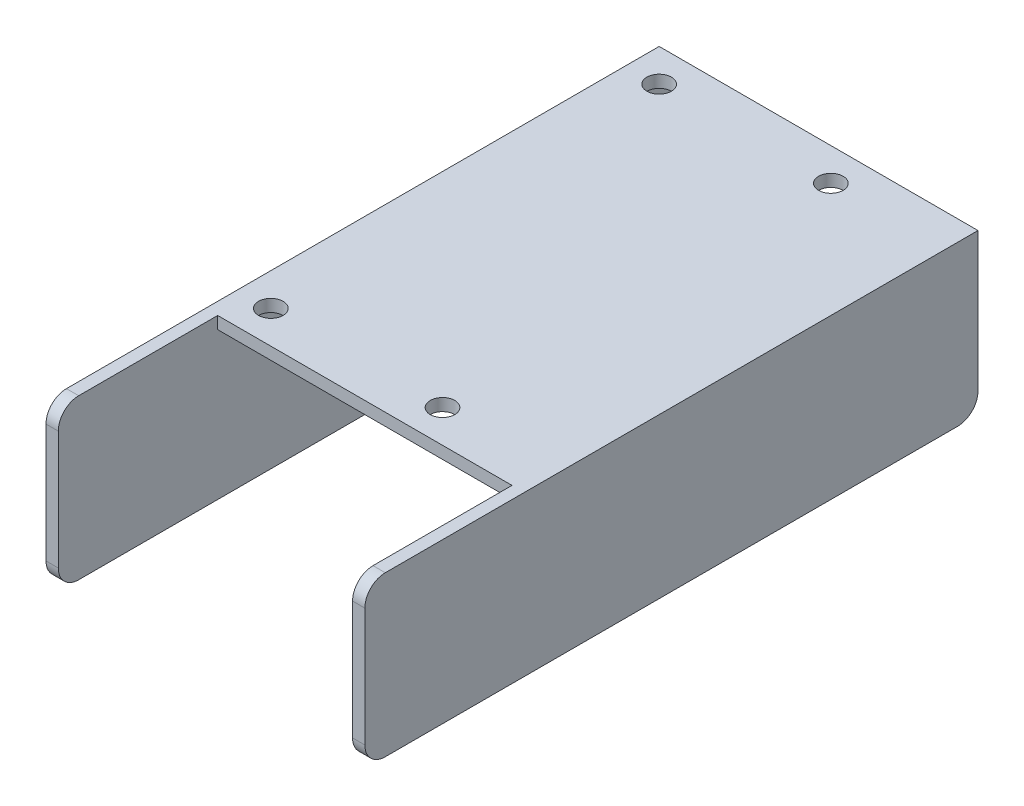
ISO-10303-21;
HEADER;
FILE_DESCRIPTION(('STEP AP214'),'2;1');
FILE_NAME('part.step','',(''),(''),'','','');
FILE_SCHEMA(('AUTOMOTIVE_DESIGN { 1 0 10303 214 1 1 1 1 }'));
ENDSEC;
DATA;
#1=APPLICATION_CONTEXT('core data for automotive mechanical design processes');
#2=APPLICATION_PROTOCOL_DEFINITION('international standard','automotive_design',2000,#1);
#3=PRODUCT_CONTEXT('',#1,'mechanical');
#4=PRODUCT('Part','Part','',(#3));
#5=PRODUCT_RELATED_PRODUCT_CATEGORY('part','',(#4));
#6=PRODUCT_DEFINITION_FORMATION('','',#4);
#7=PRODUCT_DEFINITION_CONTEXT('part definition',#1,'design');
#8=PRODUCT_DEFINITION('design','',#6,#7);
#9=PRODUCT_DEFINITION_SHAPE('','',#8);
#10=(LENGTH_UNIT() NAMED_UNIT(*) SI_UNIT(.MILLI.,.METRE.));
#11=(NAMED_UNIT(*) PLANE_ANGLE_UNIT() SI_UNIT($,.RADIAN.));
#12=(NAMED_UNIT(*) SI_UNIT($,.STERADIAN.) SOLID_ANGLE_UNIT());
#13=UNCERTAINTY_MEASURE_WITH_UNIT(LENGTH_MEASURE(1.E-05),#10,'distance_accuracy_value','');
#14=(GEOMETRIC_REPRESENTATION_CONTEXT(3) GLOBAL_UNCERTAINTY_ASSIGNED_CONTEXT((#13)) GLOBAL_UNIT_ASSIGNED_CONTEXT((#10,
#11,#12)) REPRESENTATION_CONTEXT('',''));
#15=CARTESIAN_POINT('',(0.,0.,0.));
#16=DIRECTION('',(0.,0.,1.));
#17=DIRECTION('',(1.,0.,0.));
#18=AXIS2_PLACEMENT_3D('',#15,#16,#17);
#19=CARTESIAN_POINT('',(-36.,19.5,75.));
#20=DIRECTION('',(0.,0.,-1.));
#21=DIRECTION('',(-1.,0.,0.));
#22=AXIS2_PLACEMENT_3D('',#19,#20,#21);
#23=PLANE('',#22);
#24=DIRECTION('',(0.,-1.,0.));
#25=VECTOR('',#24,1.);
#26=CARTESIAN_POINT('',(36.,19.5,75.));
#27=LINE('',#26,#25);
#28=CARTESIAN_POINT('',(36.,14.5,75.));
#29=VERTEX_POINT('',#28);
#30=CARTESIAN_POINT('',(36.,-14.5,75.));
#31=VERTEX_POINT('',#30);
#32=EDGE_CURVE('E197',#29,#31,#27,.T.);
#33=ORIENTED_EDGE('',*,*,#32,.T.);
#34=DIRECTION('',(1.,0.,0.));
#35=VECTOR('',#34,1.);
#36=CARTESIAN_POINT('',(-36.,-14.5,75.));
#37=LINE('',#36,#35);
#38=CARTESIAN_POINT('',(39.,-14.5,75.));
#39=VERTEX_POINT('',#38);
#40=EDGE_CURVE('E271',#31,#39,#37,.T.);
#41=ORIENTED_EDGE('',*,*,#40,.T.);
#42=DIRECTION('',(0.,-1.,0.));
#43=VECTOR('',#42,1.);
#44=CARTESIAN_POINT('',(39.,19.5,75.));
#45=LINE('',#44,#43);
#46=CARTESIAN_POINT('',(39.,14.5,75.));
#47=VERTEX_POINT('',#46);
#48=EDGE_CURVE('E218',#47,#39,#45,.T.);
#49=ORIENTED_EDGE('',*,*,#48,.F.);
#50=DIRECTION('',(1.,0.,0.));
#51=VECTOR('',#50,1.);
#52=CARTESIAN_POINT('',(36.,14.5,75.));
#53=LINE('',#52,#51);
#54=EDGE_CURVE('E269',#47,#29,#53,.F.);
#55=ORIENTED_EDGE('',*,*,#54,.T.);
#56=EDGE_LOOP('',(#33,#41,#49,#55));
#57=FACE_BOUND('',#56,.T.);
#58=ADVANCED_FACE('F33',(#57),#23,.F.);
#59=CARTESIAN_POINT('',(0.,19.5,0.));
#60=DIRECTION('',(0.,1.,0.));
#61=DIRECTION('',(0.,0.,1.));
#62=AXIS2_PLACEMENT_3D('',#59,#60,#61);
#63=PLANE('',#62);
#64=CARTESIAN_POINT('',(11.,19.5,28.));
#65=DIRECTION('',(0.,1.,0.));
#66=DIRECTION('',(0.,0.,1.));
#67=AXIS2_PLACEMENT_3D('',#64,#65,#66);
#68=CIRCLE('',#67,3.);
#69=CARTESIAN_POINT('',(11.,19.5,31.));
#70=VERTEX_POINT('',#69);
#71=EDGE_CURVE('E554',#70,#70,#68,.T.);
#72=ORIENTED_EDGE('',*,*,#71,.F.);
#73=EDGE_LOOP('',(#72));
#74=FACE_BOUND('',#73,.T.);
#75=CARTESIAN_POINT('',(11.,19.5,-67.));
#76=DIRECTION('',(0.,1.,0.));
#77=DIRECTION('',(0.,0.,1.));
#78=AXIS2_PLACEMENT_3D('',#75,#76,#77);
#79=CIRCLE('',#78,3.);
#80=CARTESIAN_POINT('',(11.,19.5,-64.));
#81=VERTEX_POINT('',#80);
#82=EDGE_CURVE('E558',#81,#81,#79,.T.);
#83=ORIENTED_EDGE('',*,*,#82,.F.);
#84=EDGE_LOOP('',(#83));
#85=FACE_BOUND('',#84,.T.);
#86=CARTESIAN_POINT('',(-31.,19.5,28.));
#87=DIRECTION('',(0.,1.,0.));
#88=DIRECTION('',(0.,0.,1.));
#89=AXIS2_PLACEMENT_3D('',#86,#87,#88);
#90=CIRCLE('',#89,3.);
#91=CARTESIAN_POINT('',(-31.,19.5,31.));
#92=VERTEX_POINT('',#91);
#93=EDGE_CURVE('E567',#92,#92,#90,.T.);
#94=ORIENTED_EDGE('',*,*,#93,.F.);
#95=EDGE_LOOP('',(#94));
#96=FACE_BOUND('',#95,.T.);
#97=CARTESIAN_POINT('',(-31.,19.5,-67.));
#98=DIRECTION('',(0.,1.,0.));
#99=DIRECTION('',(0.,0.,1.));
#100=AXIS2_PLACEMENT_3D('',#97,#98,#99);
#101=CIRCLE('',#100,3.);
#102=CARTESIAN_POINT('',(-31.,19.5,-64.));
#103=VERTEX_POINT('',#102);
#104=EDGE_CURVE('E177',#103,#103,#101,.T.);
#105=ORIENTED_EDGE('',*,*,#104,.F.);
#106=EDGE_LOOP('',(#105));
#107=FACE_BOUND('',#106,.T.);
#108=DIRECTION('',(0.,0.,1.));
#109=VECTOR('',#108,1.);
#110=CARTESIAN_POINT('',(36.,19.5,75.));
#111=LINE('',#110,#109);
#112=CARTESIAN_POINT('',(36.,19.5,36.));
#113=VERTEX_POINT('',#112);
#114=CARTESIAN_POINT('',(36.,19.5,70.));
#115=VERTEX_POINT('',#114);
#116=EDGE_CURVE('E153',#113,#115,#111,.T.);
#117=ORIENTED_EDGE('',*,*,#116,.T.);
#118=DIRECTION('',(1.,0.,0.));
#119=VECTOR('',#118,1.);
#120=CARTESIAN_POINT('',(39.,19.5,70.));
#121=LINE('',#120,#119);
#122=CARTESIAN_POINT('',(39.,19.5,70.));
#123=VERTEX_POINT('',#122);
#124=EDGE_CURVE('E11',#115,#123,#121,.T.);
#125=ORIENTED_EDGE('',*,*,#124,.T.);
#126=DIRECTION('',(0.,0.,1.));
#127=VECTOR('',#126,1.);
#128=CARTESIAN_POINT('',(39.,19.5,-75.));
#129=LINE('',#128,#127);
#130=CARTESIAN_POINT('',(39.,19.5,-75.));
#131=VERTEX_POINT('',#130);
#132=EDGE_CURVE('E211',#131,#123,#129,.T.);
#133=ORIENTED_EDGE('',*,*,#132,.F.);
#134=DIRECTION('',(-1.,0.,0.));
#135=VECTOR('',#134,1.);
#136=CARTESIAN_POINT('',(0.,19.5,-75.));
#137=LINE('',#136,#135);
#138=CARTESIAN_POINT('',(-39.,19.5,-75.));
#139=VERTEX_POINT('',#138);
#140=EDGE_CURVE('E221',#131,#139,#137,.T.);
#141=ORIENTED_EDGE('',*,*,#140,.T.);
#142=DIRECTION('',(0.,0.,1.));
#143=VECTOR('',#142,1.);
#144=CARTESIAN_POINT('',(-39.,19.5,-75.));
#145=LINE('',#144,#143);
#146=CARTESIAN_POINT('',(-39.,19.5,70.));
#147=VERTEX_POINT('',#146);
#148=EDGE_CURVE('E223',#139,#147,#145,.T.);
#149=ORIENTED_EDGE('',*,*,#148,.T.);
#150=DIRECTION('',(1.,0.,0.));
#151=VECTOR('',#150,1.);
#152=CARTESIAN_POINT('',(-36.,19.5,70.));
#153=LINE('',#152,#151);
#154=CARTESIAN_POINT('',(-36.,19.5,70.));
#155=VERTEX_POINT('',#154);
#156=EDGE_CURVE('E41',#147,#155,#153,.T.);
#157=ORIENTED_EDGE('',*,*,#156,.T.);
#158=DIRECTION('',(0.,0.,1.));
#159=VECTOR('',#158,1.);
#160=CARTESIAN_POINT('',(-36.,19.5,75.));
#161=LINE('',#160,#159);
#162=CARTESIAN_POINT('',(-36.,19.5,36.));
#163=VERTEX_POINT('',#162);
#164=EDGE_CURVE('E157',#163,#155,#161,.T.);
#165=ORIENTED_EDGE('',*,*,#164,.F.);
#166=DIRECTION('',(-1.,0.,0.));
#167=VECTOR('',#166,1.);
#168=CARTESIAN_POINT('',(-36.,19.5,36.));
#169=LINE('',#168,#167);
#170=EDGE_CURVE('E149',#113,#163,#169,.T.);
#171=ORIENTED_EDGE('',*,*,#170,.F.);
#172=EDGE_LOOP('',(#117,#125,#133,#141,#149,#157,#165,#171));
#173=FACE_BOUND('',#172,.T.);
#174=ADVANCED_FACE('F151',(#74,#85,#96,#107,#173),#63,.T.);
#175=CARTESIAN_POINT('',(0.,16.5,0.));
#176=DIRECTION('',(0.,1.,0.));
#177=DIRECTION('',(0.,0.,1.));
#178=AXIS2_PLACEMENT_3D('',#175,#176,#177);
#179=PLANE('',#178);
#180=CARTESIAN_POINT('',(11.,16.5,28.));
#181=DIRECTION('',(0.,1.,0.));
#182=DIRECTION('',(0.,0.,1.));
#183=AXIS2_PLACEMENT_3D('',#180,#181,#182);
#184=CIRCLE('',#183,3.);
#185=CARTESIAN_POINT('',(11.,16.5,31.));
#186=VERTEX_POINT('',#185);
#187=EDGE_CURVE('E557',#186,#186,#184,.F.);
#188=ORIENTED_EDGE('',*,*,#187,.F.);
#189=EDGE_LOOP('',(#188));
#190=FACE_BOUND('',#189,.T.);
#191=CARTESIAN_POINT('',(11.,16.5,-67.));
#192=DIRECTION('',(0.,1.,0.));
#193=DIRECTION('',(0.,0.,1.));
#194=AXIS2_PLACEMENT_3D('',#191,#192,#193);
#195=CIRCLE('',#194,3.);
#196=CARTESIAN_POINT('',(11.,16.5,-64.));
#197=VERTEX_POINT('',#196);
#198=EDGE_CURVE('E561',#197,#197,#195,.F.);
#199=ORIENTED_EDGE('',*,*,#198,.F.);
#200=EDGE_LOOP('',(#199));
#201=FACE_BOUND('',#200,.T.);
#202=CARTESIAN_POINT('',(-31.,16.5,28.));
#203=DIRECTION('',(0.,1.,0.));
#204=DIRECTION('',(0.,0.,1.));
#205=AXIS2_PLACEMENT_3D('',#202,#203,#204);
#206=CIRCLE('',#205,3.);
#207=CARTESIAN_POINT('',(-31.,16.5,31.));
#208=VERTEX_POINT('',#207);
#209=EDGE_CURVE('E570',#208,#208,#206,.F.);
#210=ORIENTED_EDGE('',*,*,#209,.F.);
#211=EDGE_LOOP('',(#210));
#212=FACE_BOUND('',#211,.T.);
#213=CARTESIAN_POINT('',(-31.,16.5,-67.));
#214=DIRECTION('',(0.,1.,0.));
#215=DIRECTION('',(0.,0.,1.));
#216=AXIS2_PLACEMENT_3D('',#213,#214,#215);
#217=CIRCLE('',#216,3.);
#218=CARTESIAN_POINT('',(-31.,16.5,-64.));
#219=VERTEX_POINT('',#218);
#220=EDGE_CURVE('E174',#219,#219,#217,.F.);
#221=ORIENTED_EDGE('',*,*,#220,.F.);
#222=EDGE_LOOP('',(#221));
#223=FACE_BOUND('',#222,.T.);
#224=DIRECTION('',(0.,0.,1.));
#225=VECTOR('',#224,1.);
#226=CARTESIAN_POINT('',(36.,16.5,-75.));
#227=LINE('',#226,#225);
#228=CARTESIAN_POINT('',(36.,16.5,-75.));
#229=VERTEX_POINT('',#228);
#230=CARTESIAN_POINT('',(36.,16.5,36.));
#231=VERTEX_POINT('',#230);
#232=EDGE_CURVE('E191',#229,#231,#227,.T.);
#233=ORIENTED_EDGE('',*,*,#232,.T.);
#234=DIRECTION('',(1.,0.,0.));
#235=VECTOR('',#234,1.);
#236=CARTESIAN_POINT('',(-36.,16.5,36.));
#237=LINE('',#236,#235);
#238=CARTESIAN_POINT('',(-36.,16.5,36.));
#239=VERTEX_POINT('',#238);
#240=EDGE_CURVE('E159',#239,#231,#237,.T.);
#241=ORIENTED_EDGE('',*,*,#240,.F.);
#242=DIRECTION('',(0.,0.,1.));
#243=VECTOR('',#242,1.);
#244=CARTESIAN_POINT('',(-36.,16.5,-75.));
#245=LINE('',#244,#243);
#246=CARTESIAN_POINT('',(-36.,16.5,-75.));
#247=VERTEX_POINT('',#246);
#248=EDGE_CURVE('E186',#247,#239,#245,.T.);
#249=ORIENTED_EDGE('',*,*,#248,.F.);
#250=DIRECTION('',(-1.,0.,0.));
#251=VECTOR('',#250,1.);
#252=CARTESIAN_POINT('',(0.,16.5,-75.));
#253=LINE('',#252,#251);
#254=EDGE_CURVE('E190',#229,#247,#253,.T.);
#255=ORIENTED_EDGE('',*,*,#254,.F.);
#256=EDGE_LOOP('',(#233,#241,#249,#255));
#257=FACE_BOUND('',#256,.T.);
#258=ADVANCED_FACE('F287',(#190,#201,#212,#223,#257),#179,.F.);
#259=DIRECTION('',(0.,-1.,0.));
#260=VECTOR('',#259,1.);
#261=CARTESIAN_POINT('',(-39.,19.5,75.));
#262=LINE('',#261,#260);
#263=CARTESIAN_POINT('',(-39.,14.5,75.));
#264=VERTEX_POINT('',#263);
#265=CARTESIAN_POINT('',(-39.,-14.5,75.));
#266=VERTEX_POINT('',#265);
#267=EDGE_CURVE('E226',#264,#266,#262,.T.);
#268=ORIENTED_EDGE('',*,*,#267,.T.);
#269=DIRECTION('',(1.,0.,0.));
#270=VECTOR('',#269,1.);
#271=CARTESIAN_POINT('',(-36.,-14.5,75.));
#272=LINE('',#271,#270);
#273=CARTESIAN_POINT('',(-36.,-14.5,75.));
#274=VERTEX_POINT('',#273);
#275=EDGE_CURVE('E275',#266,#274,#272,.T.);
#276=ORIENTED_EDGE('',*,*,#275,.T.);
#277=DIRECTION('',(0.,-1.,0.));
#278=VECTOR('',#277,1.);
#279=CARTESIAN_POINT('',(-36.,19.5,75.));
#280=LINE('',#279,#278);
#281=CARTESIAN_POINT('',(-36.,14.5,75.));
#282=VERTEX_POINT('',#281);
#283=EDGE_CURVE('E189',#282,#274,#280,.T.);
#284=ORIENTED_EDGE('',*,*,#283,.F.);
#285=DIRECTION('',(1.,0.,0.));
#286=VECTOR('',#285,1.);
#287=CARTESIAN_POINT('',(-39.,14.5,75.));
#288=LINE('',#287,#286);
#289=EDGE_CURVE('E273',#282,#264,#288,.F.);
#290=ORIENTED_EDGE('',*,*,#289,.T.);
#291=EDGE_LOOP('',(#268,#276,#284,#290));
#292=FACE_BOUND('',#291,.T.);
#293=ADVANCED_FACE('F324',(#292),#23,.F.);
#294=CARTESIAN_POINT('',(0.,-19.5,0.));
#295=DIRECTION('',(0.,1.,0.));
#296=DIRECTION('',(0.,0.,1.));
#297=AXIS2_PLACEMENT_3D('',#294,#295,#296);
#298=PLANE('',#297);
#299=DIRECTION('',(0.,0.,1.));
#300=VECTOR('',#299,1.);
#301=CARTESIAN_POINT('',(36.,-19.5,-75.));
#302=LINE('',#301,#300);
#303=CARTESIAN_POINT('',(36.,-19.5,-70.));
#304=VERTEX_POINT('',#303);
#305=CARTESIAN_POINT('',(36.,-19.5,70.));
#306=VERTEX_POINT('',#305);
#307=EDGE_CURVE('E185',#304,#306,#302,.T.);
#308=ORIENTED_EDGE('',*,*,#307,.F.);
#309=DIRECTION('',(-1.,0.,0.));
#310=VECTOR('',#309,1.);
#311=CARTESIAN_POINT('',(0.,-19.5,-70.));
#312=LINE('',#311,#310);
#313=CARTESIAN_POINT('',(39.,-19.5,-70.));
#314=VERTEX_POINT('',#313);
#315=EDGE_CURVE('E263',#304,#314,#312,.F.);
#316=ORIENTED_EDGE('',*,*,#315,.T.);
#317=DIRECTION('',(0.,0.,1.));
#318=VECTOR('',#317,1.);
#319=CARTESIAN_POINT('',(39.,-19.5,-75.));
#320=LINE('',#319,#318);
#321=CARTESIAN_POINT('',(39.,-19.5,70.));
#322=VERTEX_POINT('',#321);
#323=EDGE_CURVE('E201',#314,#322,#320,.T.);
#324=ORIENTED_EDGE('',*,*,#323,.T.);
#325=DIRECTION('',(1.,0.,0.));
#326=VECTOR('',#325,1.);
#327=CARTESIAN_POINT('',(0.,-19.5,70.));
#328=LINE('',#327,#326);
#329=EDGE_CURVE('E261',#322,#306,#328,.F.);
#330=ORIENTED_EDGE('',*,*,#329,.T.);
#331=EDGE_LOOP('',(#308,#316,#324,#330));
#332=FACE_BOUND('',#331,.T.);
#333=ADVANCED_FACE('F300',(#332),#298,.F.);
#334=CARTESIAN_POINT('',(0.,19.5,-75.));
#335=DIRECTION('',(0.,0.,1.));
#336=DIRECTION('',(1.,0.,0.));
#337=AXIS2_PLACEMENT_3D('',#334,#335,#336);
#338=PLANE('',#337);
#339=DIRECTION('',(0.,-1.,0.));
#340=VECTOR('',#339,1.);
#341=CARTESIAN_POINT('',(-36.,19.5,-75.));
#342=LINE('',#341,#340);
#343=CARTESIAN_POINT('',(-36.,-14.5,-75.));
#344=VERTEX_POINT('',#343);
#345=EDGE_CURVE('E198',#247,#344,#342,.T.);
#346=ORIENTED_EDGE('',*,*,#345,.T.);
#347=DIRECTION('',(-1.,0.,0.));
#348=VECTOR('',#347,1.);
#349=CARTESIAN_POINT('',(0.,-14.5,-75.));
#350=LINE('',#349,#348);
#351=CARTESIAN_POINT('',(-39.,-14.5,-75.));
#352=VERTEX_POINT('',#351);
#353=EDGE_CURVE('E237',#344,#352,#350,.T.);
#354=ORIENTED_EDGE('',*,*,#353,.T.);
#355=DIRECTION('',(0.,-1.,0.));
#356=VECTOR('',#355,1.);
#357=CARTESIAN_POINT('',(-39.,19.5,-75.));
#358=LINE('',#357,#356);
#359=EDGE_CURVE('E231',#139,#352,#358,.T.);
#360=ORIENTED_EDGE('',*,*,#359,.F.);
#361=ORIENTED_EDGE('',*,*,#140,.F.);
#362=DIRECTION('',(0.,-1.,0.));
#363=VECTOR('',#362,1.);
#364=CARTESIAN_POINT('',(39.,19.5,-75.));
#365=LINE('',#364,#363);
#366=CARTESIAN_POINT('',(39.,-14.5,-75.));
#367=VERTEX_POINT('',#366);
#368=EDGE_CURVE('E213',#131,#367,#365,.T.);
#369=ORIENTED_EDGE('',*,*,#368,.T.);
#370=DIRECTION('',(-1.,0.,0.));
#371=VECTOR('',#370,1.);
#372=CARTESIAN_POINT('',(0.,-14.5,-75.));
#373=LINE('',#372,#371);
#374=CARTESIAN_POINT('',(36.,-14.5,-75.));
#375=VERTEX_POINT('',#374);
#376=EDGE_CURVE('E234',#367,#375,#373,.T.);
#377=ORIENTED_EDGE('',*,*,#376,.T.);
#378=DIRECTION('',(0.,-1.,0.));
#379=VECTOR('',#378,1.);
#380=CARTESIAN_POINT('',(36.,19.5,-75.));
#381=LINE('',#380,#379);
#382=EDGE_CURVE('E193',#229,#375,#381,.T.);
#383=ORIENTED_EDGE('',*,*,#382,.F.);
#384=ORIENTED_EDGE('',*,*,#254,.T.);
#385=EDGE_LOOP('',(#346,#354,#360,#361,#369,#377,#383,#384));
#386=FACE_BOUND('',#385,.T.);
#387=ADVANCED_FACE('F290',(#386),#338,.F.);
#388=CARTESIAN_POINT('',(-39.,19.5,-75.));
#389=DIRECTION('',(1.,0.,0.));
#390=DIRECTION('',(0.,0.,-1.));
#391=AXIS2_PLACEMENT_3D('',#388,#389,#390);
#392=PLANE('',#391);
#393=ORIENTED_EDGE('',*,*,#359,.T.);
#394=CARTESIAN_POINT('',(-39.,-14.5,-70.));
#395=DIRECTION('',(1.,0.,0.));
#396=DIRECTION('',(0.,0.,-1.));
#397=AXIS2_PLACEMENT_3D('',#394,#395,#396);
#398=CIRCLE('',#397,5.);
#399=CARTESIAN_POINT('',(-39.,-19.5,-70.));
#400=VERTEX_POINT('',#399);
#401=EDGE_CURVE('E244',#352,#400,#398,.F.);
#402=ORIENTED_EDGE('',*,*,#401,.T.);
#403=DIRECTION('',(0.,0.,1.));
#404=VECTOR('',#403,1.);
#405=CARTESIAN_POINT('',(-39.,-19.5,-75.));
#406=LINE('',#405,#404);
#407=CARTESIAN_POINT('',(-39.,-19.5,70.));
#408=VERTEX_POINT('',#407);
#409=EDGE_CURVE('E220',#400,#408,#406,.T.);
#410=ORIENTED_EDGE('',*,*,#409,.T.);
#411=CARTESIAN_POINT('',(-39.,-14.5,70.));
#412=DIRECTION('',(1.,0.,0.));
#413=DIRECTION('',(0.,0.,-1.));
#414=AXIS2_PLACEMENT_3D('',#411,#412,#413);
#415=CIRCLE('',#414,5.);
#416=EDGE_CURVE('E242',#408,#266,#415,.F.);
#417=ORIENTED_EDGE('',*,*,#416,.T.);
#418=ORIENTED_EDGE('',*,*,#267,.F.);
#419=CARTESIAN_POINT('',(-39.,14.5,70.));
#420=DIRECTION('',(1.,0.,0.));
#421=DIRECTION('',(0.,0.,-1.));
#422=AXIS2_PLACEMENT_3D('',#419,#420,#421);
#423=CIRCLE('',#422,5.);
#424=EDGE_CURVE('E240',#264,#147,#423,.F.);
#425=ORIENTED_EDGE('',*,*,#424,.T.);
#426=ORIENTED_EDGE('',*,*,#148,.F.);
#427=EDGE_LOOP('',(#393,#402,#410,#417,#418,#425,#426));
#428=FACE_BOUND('',#427,.T.);
#429=ADVANCED_FACE('F317',(#428),#392,.F.);
#430=ORIENTED_EDGE('',*,*,#409,.F.);
#431=DIRECTION('',(-1.,0.,0.));
#432=VECTOR('',#431,1.);
#433=CARTESIAN_POINT('',(0.,-19.5,-70.));
#434=LINE('',#433,#432);
#435=CARTESIAN_POINT('',(-36.,-19.5,-70.));
#436=VERTEX_POINT('',#435);
#437=EDGE_CURVE('E248',#400,#436,#434,.F.);
#438=ORIENTED_EDGE('',*,*,#437,.T.);
#439=DIRECTION('',(0.,0.,1.));
#440=VECTOR('',#439,1.);
#441=CARTESIAN_POINT('',(-36.,-19.5,-75.));
#442=LINE('',#441,#440);
#443=CARTESIAN_POINT('',(-36.,-19.5,70.));
#444=VERTEX_POINT('',#443);
#445=EDGE_CURVE('E194',#436,#444,#442,.T.);
#446=ORIENTED_EDGE('',*,*,#445,.T.);
#447=DIRECTION('',(1.,0.,0.));
#448=VECTOR('',#447,1.);
#449=CARTESIAN_POINT('',(0.,-19.5,70.));
#450=LINE('',#449,#448);
#451=EDGE_CURVE('E246',#444,#408,#450,.F.);
#452=ORIENTED_EDGE('',*,*,#451,.T.);
#453=EDGE_LOOP('',(#430,#438,#446,#452));
#454=FACE_BOUND('',#453,.T.);
#455=ADVANCED_FACE('F310',(#454),#298,.F.);
#456=CARTESIAN_POINT('',(39.,19.5,-75.));
#457=DIRECTION('',(1.,0.,0.));
#458=DIRECTION('',(0.,0.,-1.));
#459=AXIS2_PLACEMENT_3D('',#456,#457,#458);
#460=PLANE('',#459);
#461=ORIENTED_EDGE('',*,*,#323,.F.);
#462=CARTESIAN_POINT('',(39.,-14.5,-70.));
#463=DIRECTION('',(1.,0.,0.));
#464=DIRECTION('',(0.,0.,-1.));
#465=AXIS2_PLACEMENT_3D('',#462,#463,#464);
#466=CIRCLE('',#465,5.);
#467=EDGE_CURVE('E267',#314,#367,#466,.T.);
#468=ORIENTED_EDGE('',*,*,#467,.T.);
#469=ORIENTED_EDGE('',*,*,#368,.F.);
#470=ORIENTED_EDGE('',*,*,#132,.T.);
#471=CARTESIAN_POINT('',(39.,14.5,70.));
#472=DIRECTION('',(1.,0.,0.));
#473=DIRECTION('',(0.,0.,-1.));
#474=AXIS2_PLACEMENT_3D('',#471,#472,#473);
#475=CIRCLE('',#474,5.);
#476=EDGE_CURVE('E56',#123,#47,#475,.T.);
#477=ORIENTED_EDGE('',*,*,#476,.T.);
#478=ORIENTED_EDGE('',*,*,#48,.T.);
#479=CARTESIAN_POINT('',(39.,-14.5,70.));
#480=DIRECTION('',(1.,0.,0.));
#481=DIRECTION('',(0.,0.,-1.));
#482=AXIS2_PLACEMENT_3D('',#479,#480,#481);
#483=CIRCLE('',#482,5.);
#484=EDGE_CURVE('E48',#39,#322,#483,.T.);
#485=ORIENTED_EDGE('',*,*,#484,.T.);
#486=EDGE_LOOP('',(#461,#468,#469,#470,#477,#478,#485));
#487=FACE_BOUND('',#486,.T.);
#488=ADVANCED_FACE('F308',(#487),#460,.T.);
#489=CARTESIAN_POINT('',(-36.,19.5,-75.));
#490=DIRECTION('',(1.,0.,0.));
#491=DIRECTION('',(0.,0.,-1.));
#492=AXIS2_PLACEMENT_3D('',#489,#490,#491);
#493=PLANE('',#492);
#494=ORIENTED_EDGE('',*,*,#445,.F.);
#495=CARTESIAN_POINT('',(-36.,-14.5,-70.));
#496=DIRECTION('',(1.,0.,0.));
#497=DIRECTION('',(0.,0.,-1.));
#498=AXIS2_PLACEMENT_3D('',#495,#496,#497);
#499=CIRCLE('',#498,5.);
#500=EDGE_CURVE('E254',#436,#344,#499,.T.);
#501=ORIENTED_EDGE('',*,*,#500,.T.);
#502=ORIENTED_EDGE('',*,*,#345,.F.);
#503=ORIENTED_EDGE('',*,*,#248,.T.);
#504=DIRECTION('',(0.,1.,0.));
#505=VECTOR('',#504,1.);
#506=CARTESIAN_POINT('',(-36.,-19.501,36.));
#507=LINE('',#506,#505);
#508=EDGE_CURVE('E183',#239,#163,#507,.T.);
#509=ORIENTED_EDGE('',*,*,#508,.T.);
#510=ORIENTED_EDGE('',*,*,#164,.T.);
#511=CARTESIAN_POINT('',(-36.,14.5,70.));
#512=DIRECTION('',(1.,0.,0.));
#513=DIRECTION('',(0.,0.,-1.));
#514=AXIS2_PLACEMENT_3D('',#511,#512,#513);
#515=CIRCLE('',#514,5.);
#516=EDGE_CURVE('E250',#155,#282,#515,.T.);
#517=ORIENTED_EDGE('',*,*,#516,.T.);
#518=ORIENTED_EDGE('',*,*,#283,.T.);
#519=CARTESIAN_POINT('',(-36.,-14.5,70.));
#520=DIRECTION('',(1.,0.,0.));
#521=DIRECTION('',(0.,0.,-1.));
#522=AXIS2_PLACEMENT_3D('',#519,#520,#521);
#523=CIRCLE('',#522,5.);
#524=EDGE_CURVE('E252',#274,#444,#523,.T.);
#525=ORIENTED_EDGE('',*,*,#524,.T.);
#526=EDGE_LOOP('',(#494,#501,#502,#503,#509,#510,#517,#518,#525));
#527=FACE_BOUND('',#526,.T.);
#528=ADVANCED_FACE('F283',(#527),#493,.T.);
#529=CARTESIAN_POINT('',(36.,19.5,-75.));
#530=DIRECTION('',(1.,0.,0.));
#531=DIRECTION('',(0.,0.,-1.));
#532=AXIS2_PLACEMENT_3D('',#529,#530,#531);
#533=PLANE('',#532);
#534=ORIENTED_EDGE('',*,*,#382,.T.);
#535=CARTESIAN_POINT('',(36.,-14.5,-70.));
#536=DIRECTION('',(1.,0.,0.));
#537=DIRECTION('',(0.,0.,-1.));
#538=AXIS2_PLACEMENT_3D('',#535,#536,#537);
#539=CIRCLE('',#538,5.);
#540=EDGE_CURVE('E259',#375,#304,#539,.F.);
#541=ORIENTED_EDGE('',*,*,#540,.T.);
#542=ORIENTED_EDGE('',*,*,#307,.T.);
#543=CARTESIAN_POINT('',(36.,-14.5,70.));
#544=DIRECTION('',(1.,0.,0.));
#545=DIRECTION('',(0.,0.,-1.));
#546=AXIS2_PLACEMENT_3D('',#543,#544,#545);
#547=CIRCLE('',#546,5.);
#548=EDGE_CURVE('E257',#306,#31,#547,.F.);
#549=ORIENTED_EDGE('',*,*,#548,.T.);
#550=ORIENTED_EDGE('',*,*,#32,.F.);
#551=CARTESIAN_POINT('',(36.,14.5,70.));
#552=DIRECTION('',(1.,0.,0.));
#553=DIRECTION('',(0.,0.,-1.));
#554=AXIS2_PLACEMENT_3D('',#551,#552,#553);
#555=CIRCLE('',#554,5.);
#556=EDGE_CURVE('E173',#29,#115,#555,.F.);
#557=ORIENTED_EDGE('',*,*,#556,.T.);
#558=ORIENTED_EDGE('',*,*,#116,.F.);
#559=DIRECTION('',(0.,1.,0.));
#560=VECTOR('',#559,1.);
#561=CARTESIAN_POINT('',(36.,-19.501,36.));
#562=LINE('',#561,#560);
#563=EDGE_CURVE('E162',#231,#113,#562,.T.);
#564=ORIENTED_EDGE('',*,*,#563,.F.);
#565=ORIENTED_EDGE('',*,*,#232,.F.);
#566=EDGE_LOOP('',(#534,#541,#542,#549,#550,#557,#558,#564,#565));
#567=FACE_BOUND('',#566,.T.);
#568=ADVANCED_FACE('F170',(#567),#533,.F.);
#569=CARTESIAN_POINT('',(-36.,-19.501,36.));
#570=DIRECTION('',(0.,0.,-1.));
#571=DIRECTION('',(-1.,0.,0.));
#572=AXIS2_PLACEMENT_3D('',#569,#570,#571);
#573=PLANE('',#572);
#574=ORIENTED_EDGE('',*,*,#240,.T.);
#575=ORIENTED_EDGE('',*,*,#563,.T.);
#576=ORIENTED_EDGE('',*,*,#170,.T.);
#577=ORIENTED_EDGE('',*,*,#508,.F.);
#578=EDGE_LOOP('',(#574,#575,#576,#577));
#579=FACE_BOUND('',#578,.T.);
#580=ADVANCED_FACE('F163',(#579),#573,.F.);
#581=CARTESIAN_POINT('',(0.,-14.5,-70.));
#582=DIRECTION('',(-1.,0.,0.));
#583=DIRECTION('',(0.,0.,1.));
#584=AXIS2_PLACEMENT_3D('',#581,#582,#583);
#585=CYLINDRICAL_SURFACE('',#584,5.);
#586=ORIENTED_EDGE('',*,*,#500,.F.);
#587=ORIENTED_EDGE('',*,*,#437,.F.);
#588=ORIENTED_EDGE('',*,*,#401,.F.);
#589=ORIENTED_EDGE('',*,*,#353,.F.);
#590=EDGE_LOOP('',(#586,#587,#588,#589));
#591=FACE_BOUND('',#590,.T.);
#592=ADVANCED_FACE('F350',(#591),#585,.T.);
#593=CARTESIAN_POINT('',(0.,-14.5,-70.));
#594=DIRECTION('',(-1.,0.,0.));
#595=DIRECTION('',(0.,0.,1.));
#596=AXIS2_PLACEMENT_3D('',#593,#594,#595);
#597=CYLINDRICAL_SURFACE('',#596,5.);
#598=ORIENTED_EDGE('',*,*,#467,.F.);
#599=ORIENTED_EDGE('',*,*,#315,.F.);
#600=ORIENTED_EDGE('',*,*,#540,.F.);
#601=ORIENTED_EDGE('',*,*,#376,.F.);
#602=EDGE_LOOP('',(#598,#599,#600,#601));
#603=FACE_BOUND('',#602,.T.);
#604=ADVANCED_FACE('F295',(#603),#597,.T.);
#605=CARTESIAN_POINT('',(-36.,-14.5,70.));
#606=DIRECTION('',(1.,0.,0.));
#607=DIRECTION('',(0.,0.,-1.));
#608=AXIS2_PLACEMENT_3D('',#605,#606,#607);
#609=CYLINDRICAL_SURFACE('',#608,5.);
#610=ORIENTED_EDGE('',*,*,#548,.F.);
#611=ORIENTED_EDGE('',*,*,#329,.F.);
#612=ORIENTED_EDGE('',*,*,#484,.F.);
#613=ORIENTED_EDGE('',*,*,#40,.F.);
#614=EDGE_LOOP('',(#610,#611,#612,#613));
#615=FACE_BOUND('',#614,.T.);
#616=ADVANCED_FACE('F302',(#615),#609,.T.);
#617=CARTESIAN_POINT('',(-36.,-14.5,70.));
#618=DIRECTION('',(1.,0.,0.));
#619=DIRECTION('',(0.,0.,-1.));
#620=AXIS2_PLACEMENT_3D('',#617,#618,#619);
#621=CYLINDRICAL_SURFACE('',#620,5.);
#622=ORIENTED_EDGE('',*,*,#416,.F.);
#623=ORIENTED_EDGE('',*,*,#451,.F.);
#624=ORIENTED_EDGE('',*,*,#524,.F.);
#625=ORIENTED_EDGE('',*,*,#275,.F.);
#626=EDGE_LOOP('',(#622,#623,#624,#625));
#627=FACE_BOUND('',#626,.T.);
#628=ADVANCED_FACE('F344',(#627),#621,.T.);
#629=CARTESIAN_POINT('',(0.,14.5,70.));
#630=DIRECTION('',(-1.,0.,0.));
#631=DIRECTION('',(0.,0.,1.));
#632=AXIS2_PLACEMENT_3D('',#629,#630,#631);
#633=CYLINDRICAL_SURFACE('',#632,5.);
#634=ORIENTED_EDGE('',*,*,#556,.F.);
#635=ORIENTED_EDGE('',*,*,#54,.F.);
#636=ORIENTED_EDGE('',*,*,#476,.F.);
#637=ORIENTED_EDGE('',*,*,#124,.F.);
#638=EDGE_LOOP('',(#634,#635,#636,#637));
#639=FACE_BOUND('',#638,.T.);
#640=ADVANCED_FACE('F306',(#639),#633,.T.);
#641=CARTESIAN_POINT('',(0.,14.5,70.));
#642=DIRECTION('',(-1.,0.,0.));
#643=DIRECTION('',(0.,0.,1.));
#644=AXIS2_PLACEMENT_3D('',#641,#642,#643);
#645=CYLINDRICAL_SURFACE('',#644,5.);
#646=ORIENTED_EDGE('',*,*,#424,.F.);
#647=ORIENTED_EDGE('',*,*,#289,.F.);
#648=ORIENTED_EDGE('',*,*,#516,.F.);
#649=ORIENTED_EDGE('',*,*,#156,.F.);
#650=EDGE_LOOP('',(#646,#647,#648,#649));
#651=FACE_BOUND('',#650,.T.);
#652=ADVANCED_FACE('F35',(#651),#645,.T.);
#653=CARTESIAN_POINT('',(-31.,-19.501,-67.));
#654=DIRECTION('',(0.,1.,0.));
#655=DIRECTION('',(0.,0.,1.));
#656=AXIS2_PLACEMENT_3D('',#653,#654,#655);
#657=CYLINDRICAL_SURFACE('',#656,3.);
#658=ORIENTED_EDGE('',*,*,#104,.T.);
#659=EDGE_LOOP('',(#658));
#660=FACE_BOUND('',#659,.T.);
#661=ORIENTED_EDGE('',*,*,#220,.T.);
#662=EDGE_LOOP('',(#661));
#663=FACE_BOUND('',#662,.T.);
#664=ADVANCED_FACE('F354',(#660,#663),#657,.F.);
#665=CARTESIAN_POINT('',(-31.,-19.501,28.));
#666=DIRECTION('',(0.,1.,0.));
#667=DIRECTION('',(0.,0.,1.));
#668=AXIS2_PLACEMENT_3D('',#665,#666,#667);
#669=CYLINDRICAL_SURFACE('',#668,3.);
#670=ORIENTED_EDGE('',*,*,#93,.T.);
#671=EDGE_LOOP('',(#670));
#672=FACE_BOUND('',#671,.T.);
#673=ORIENTED_EDGE('',*,*,#209,.T.);
#674=EDGE_LOOP('',(#673));
#675=FACE_BOUND('',#674,.T.);
#676=ADVANCED_FACE('F359',(#672,#675),#669,.F.);
#677=CARTESIAN_POINT('',(11.,-19.501,-67.));
#678=DIRECTION('',(0.,1.,0.));
#679=DIRECTION('',(0.,0.,1.));
#680=AXIS2_PLACEMENT_3D('',#677,#678,#679);
#681=CYLINDRICAL_SURFACE('',#680,3.);
#682=ORIENTED_EDGE('',*,*,#82,.T.);
#683=EDGE_LOOP('',(#682));
#684=FACE_BOUND('',#683,.T.);
#685=ORIENTED_EDGE('',*,*,#198,.T.);
#686=EDGE_LOOP('',(#685));
#687=FACE_BOUND('',#686,.T.);
#688=ADVANCED_FACE('F472',(#684,#687),#681,.F.);
#689=CARTESIAN_POINT('',(11.,-19.501,28.));
#690=DIRECTION('',(0.,1.,0.));
#691=DIRECTION('',(0.,0.,1.));
#692=AXIS2_PLACEMENT_3D('',#689,#690,#691);
#693=CYLINDRICAL_SURFACE('',#692,3.);
#694=ORIENTED_EDGE('',*,*,#71,.T.);
#695=EDGE_LOOP('',(#694));
#696=FACE_BOUND('',#695,.T.);
#697=ORIENTED_EDGE('',*,*,#187,.T.);
#698=EDGE_LOOP('',(#697));
#699=FACE_BOUND('',#698,.T.);
#700=ADVANCED_FACE('F482',(#696,#699),#693,.F.);
#701=CLOSED_SHELL('',(#58,#174,#258,#293,#333,#387,#429,#455,#488,#528,#568,#580,#592,#604,#616,
#628,#640,#652,#664,#676,#688,#700));
#702=MANIFOLD_SOLID_BREP('B2',#701);
#703=ADVANCED_BREP_SHAPE_REPRESENTATION('',(#18,#702),#14);
#704=SHAPE_DEFINITION_REPRESENTATION(#9,#703);
ENDSEC;
END-ISO-10303-21;
